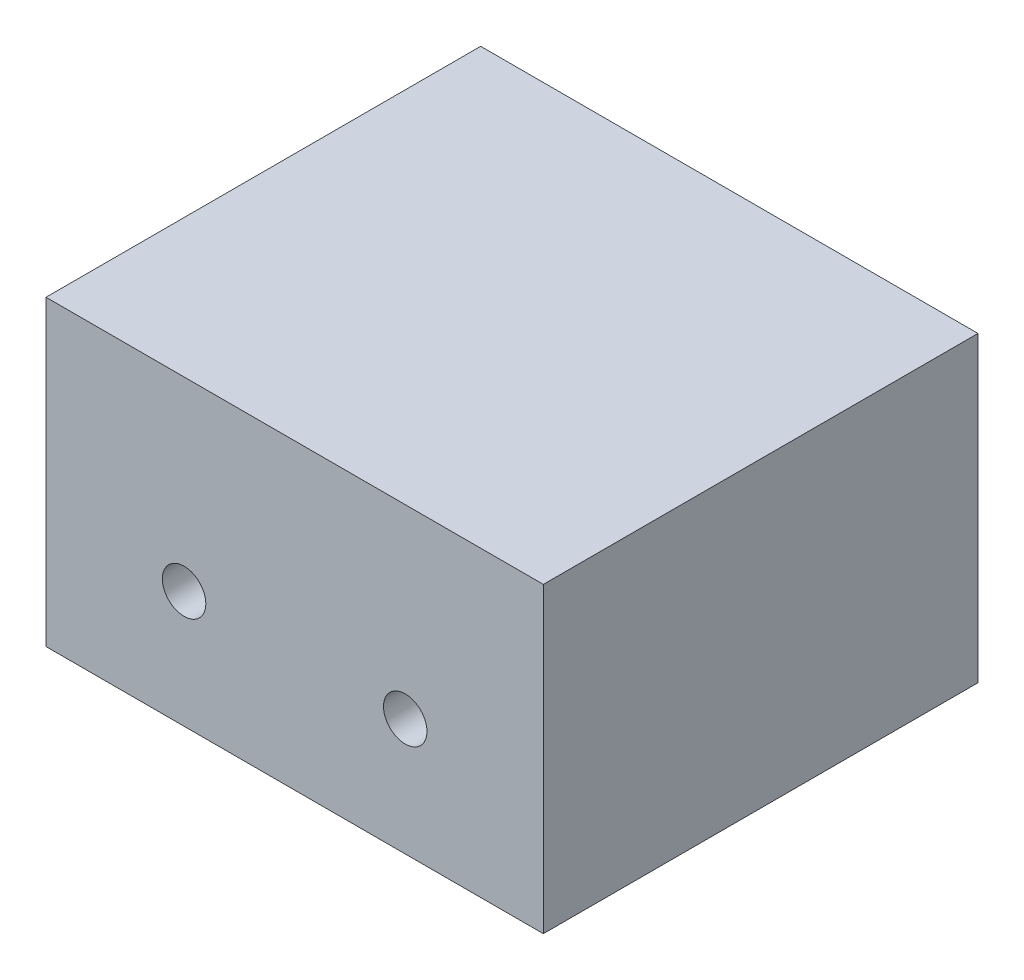
ISO-10303-21;
HEADER;
FILE_DESCRIPTION(('STEP AP214'),'2;1');
FILE_NAME('part.step','',(''),(''),'','','');
FILE_SCHEMA(('AUTOMOTIVE_DESIGN { 1 0 10303 214 1 1 1 1 }'));
ENDSEC;
DATA;
#1=APPLICATION_CONTEXT('core data for automotive mechanical design processes');
#2=APPLICATION_PROTOCOL_DEFINITION('international standard','automotive_design',2000,#1);
#3=PRODUCT_CONTEXT('',#1,'mechanical');
#4=PRODUCT('Part','Part','',(#3));
#5=PRODUCT_RELATED_PRODUCT_CATEGORY('part','',(#4));
#6=PRODUCT_DEFINITION_FORMATION('','',#4);
#7=PRODUCT_DEFINITION_CONTEXT('part definition',#1,'design');
#8=PRODUCT_DEFINITION('design','',#6,#7);
#9=PRODUCT_DEFINITION_SHAPE('','',#8);
#10=(LENGTH_UNIT() NAMED_UNIT(*) SI_UNIT(.MILLI.,.METRE.));
#11=(NAMED_UNIT(*) PLANE_ANGLE_UNIT() SI_UNIT($,.RADIAN.));
#12=(NAMED_UNIT(*) SI_UNIT($,.STERADIAN.) SOLID_ANGLE_UNIT());
#13=UNCERTAINTY_MEASURE_WITH_UNIT(LENGTH_MEASURE(1.E-05),#10,'distance_accuracy_value','');
#14=(GEOMETRIC_REPRESENTATION_CONTEXT(3) GLOBAL_UNCERTAINTY_ASSIGNED_CONTEXT((#13)) GLOBAL_UNIT_ASSIGNED_CONTEXT((#10,
#11,#12)) REPRESENTATION_CONTEXT('',''));
#15=CARTESIAN_POINT('',(0.,0.,0.));
#16=DIRECTION('',(0.,0.,1.));
#17=DIRECTION('',(1.,0.,0.));
#18=AXIS2_PLACEMENT_3D('',#15,#16,#17);
#19=CARTESIAN_POINT('',(28.605,34.8,25.));
#20=DIRECTION('',(-1.,0.,0.));
#21=DIRECTION('',(0.,0.,1.));
#22=AXIS2_PLACEMENT_3D('',#19,#20,#21);
#23=PLANE('',#22);
#24=DIRECTION('',(0.,0.,-1.));
#25=VECTOR('',#24,1.);
#26=CARTESIAN_POINT('',(28.605,0.,25.));
#27=LINE('',#26,#25);
#28=CARTESIAN_POINT('',(28.605,0.,25.));
#29=VERTEX_POINT('',#28);
#30=CARTESIAN_POINT('',(28.605,0.,-25.));
#31=VERTEX_POINT('',#30);
#32=EDGE_CURVE('E97',#29,#31,#27,.T.);
#33=ORIENTED_EDGE('',*,*,#32,.T.);
#34=DIRECTION('',(0.,-1.,0.));
#35=VECTOR('',#34,1.);
#36=CARTESIAN_POINT('',(28.605,34.8,-25.));
#37=LINE('',#36,#35);
#38=CARTESIAN_POINT('',(28.605,34.8,-25.));
#39=VERTEX_POINT('',#38);
#40=EDGE_CURVE('E11',#39,#31,#37,.T.);
#41=ORIENTED_EDGE('',*,*,#40,.F.);
#42=DIRECTION('',(0.,0.,-1.));
#43=VECTOR('',#42,1.);
#44=CARTESIAN_POINT('',(28.605,34.8,25.));
#45=LINE('',#44,#43);
#46=CARTESIAN_POINT('',(28.605,34.8,25.));
#47=VERTEX_POINT('',#46);
#48=EDGE_CURVE('E85',#47,#39,#45,.T.);
#49=ORIENTED_EDGE('',*,*,#48,.F.);
#50=DIRECTION('',(0.,-1.,0.));
#51=VECTOR('',#50,1.);
#52=CARTESIAN_POINT('',(28.605,34.8,25.));
#53=LINE('',#52,#51);
#54=EDGE_CURVE('E93',#47,#29,#53,.T.);
#55=ORIENTED_EDGE('',*,*,#54,.T.);
#56=EDGE_LOOP('',(#33,#41,#49,#55));
#57=FACE_BOUND('',#56,.T.);
#58=ADVANCED_FACE('F34',(#57),#23,.F.);
#59=CARTESIAN_POINT('',(-28.605,34.8,-25.));
#60=DIRECTION('',(0.,0.,1.));
#61=DIRECTION('',(1.,0.,0.));
#62=AXIS2_PLACEMENT_3D('',#59,#60,#61);
#63=PLANE('',#62);
#64=CARTESIAN_POINT('',(12.72,13.45,-25.));
#65=DIRECTION('',(0.,0.,-1.));
#66=DIRECTION('',(-1.,0.,0.));
#67=AXIS2_PLACEMENT_3D('',#64,#65,#66);
#68=CIRCLE('',#67,2.5);
#69=CARTESIAN_POINT('',(10.22,13.45,-25.));
#70=VERTEX_POINT('',#69);
#71=EDGE_CURVE('E114',#70,#70,#68,.T.);
#72=ORIENTED_EDGE('',*,*,#71,.F.);
#73=EDGE_LOOP('',(#72));
#74=FACE_BOUND('',#73,.T.);
#75=CARTESIAN_POINT('',(-12.72,13.45,-25.));
#76=DIRECTION('',(0.,0.,1.));
#77=DIRECTION('',(1.,0.,0.));
#78=AXIS2_PLACEMENT_3D('',#75,#76,#77);
#79=CIRCLE('',#78,2.5);
#80=CARTESIAN_POINT('',(-10.22,13.45,-25.));
#81=VERTEX_POINT('',#80);
#82=EDGE_CURVE('E100',#81,#81,#79,.T.);
#83=ORIENTED_EDGE('',*,*,#82,.T.);
#84=EDGE_LOOP('',(#83));
#85=FACE_BOUND('',#84,.T.);
#86=DIRECTION('',(-1.,0.,0.));
#87=VECTOR('',#86,1.);
#88=CARTESIAN_POINT('',(-28.605,0.,-25.));
#89=LINE('',#88,#87);
#90=CARTESIAN_POINT('',(-28.605,0.,-25.));
#91=VERTEX_POINT('',#90);
#92=EDGE_CURVE('E89',#31,#91,#89,.T.);
#93=ORIENTED_EDGE('',*,*,#92,.T.);
#94=DIRECTION('',(0.,-1.,0.));
#95=VECTOR('',#94,1.);
#96=CARTESIAN_POINT('',(-28.605,34.8,-25.));
#97=LINE('',#96,#95);
#98=CARTESIAN_POINT('',(-28.605,34.8,-25.));
#99=VERTEX_POINT('',#98);
#100=EDGE_CURVE('E42',#99,#91,#97,.T.);
#101=ORIENTED_EDGE('',*,*,#100,.F.);
#102=DIRECTION('',(-1.,0.,0.));
#103=VECTOR('',#102,1.);
#104=CARTESIAN_POINT('',(-28.605,34.8,-25.));
#105=LINE('',#104,#103);
#106=EDGE_CURVE('E80',#39,#99,#105,.T.);
#107=ORIENTED_EDGE('',*,*,#106,.F.);
#108=ORIENTED_EDGE('',*,*,#40,.T.);
#109=EDGE_LOOP('',(#93,#101,#107,#108));
#110=FACE_BOUND('',#109,.T.);
#111=ADVANCED_FACE('F88',(#74,#85,#110),#63,.F.);
#112=CARTESIAN_POINT('',(-28.605,34.8,25.));
#113=DIRECTION('',(1.,0.,0.));
#114=DIRECTION('',(0.,0.,-1.));
#115=AXIS2_PLACEMENT_3D('',#112,#113,#114);
#116=PLANE('',#115);
#117=DIRECTION('',(0.,0.,1.));
#118=VECTOR('',#117,1.);
#119=CARTESIAN_POINT('',(-28.605,0.,25.));
#120=LINE('',#119,#118);
#121=CARTESIAN_POINT('',(-28.605,0.,25.));
#122=VERTEX_POINT('',#121);
#123=EDGE_CURVE('E67',#91,#122,#120,.T.);
#124=ORIENTED_EDGE('',*,*,#123,.T.);
#125=DIRECTION('',(0.,-1.,0.));
#126=VECTOR('',#125,1.);
#127=CARTESIAN_POINT('',(-28.605,34.8,25.));
#128=LINE('',#127,#126);
#129=CARTESIAN_POINT('',(-28.605,34.8,25.));
#130=VERTEX_POINT('',#129);
#131=EDGE_CURVE('E90',#130,#122,#128,.T.);
#132=ORIENTED_EDGE('',*,*,#131,.F.);
#133=DIRECTION('',(0.,0.,1.));
#134=VECTOR('',#133,1.);
#135=CARTESIAN_POINT('',(-28.605,34.8,25.));
#136=LINE('',#135,#134);
#137=EDGE_CURVE('E83',#99,#130,#136,.T.);
#138=ORIENTED_EDGE('',*,*,#137,.F.);
#139=ORIENTED_EDGE('',*,*,#100,.T.);
#140=EDGE_LOOP('',(#124,#132,#138,#139));
#141=FACE_BOUND('',#140,.T.);
#142=ADVANCED_FACE('F91',(#141),#116,.F.);
#143=CARTESIAN_POINT('',(-28.605,34.8,25.));
#144=DIRECTION('',(0.,0.,-1.));
#145=DIRECTION('',(-1.,0.,0.));
#146=AXIS2_PLACEMENT_3D('',#143,#144,#145);
#147=PLANE('',#146);
#148=CARTESIAN_POINT('',(12.72,13.45,25.));
#149=DIRECTION('',(0.,0.,-1.));
#150=DIRECTION('',(-1.,0.,0.));
#151=AXIS2_PLACEMENT_3D('',#148,#149,#150);
#152=CIRCLE('',#151,2.5);
#153=CARTESIAN_POINT('',(10.22,13.45,25.));
#154=VERTEX_POINT('',#153);
#155=EDGE_CURVE('E117',#154,#154,#152,.T.);
#156=ORIENTED_EDGE('',*,*,#155,.T.);
#157=EDGE_LOOP('',(#156));
#158=FACE_BOUND('',#157,.T.);
#159=CARTESIAN_POINT('',(-12.72,13.45,25.));
#160=DIRECTION('',(0.,0.,1.));
#161=DIRECTION('',(1.,0.,0.));
#162=AXIS2_PLACEMENT_3D('',#159,#160,#161);
#163=CIRCLE('',#162,2.5);
#164=CARTESIAN_POINT('',(-10.22,13.45,25.));
#165=VERTEX_POINT('',#164);
#166=EDGE_CURVE('E111',#165,#165,#163,.T.);
#167=ORIENTED_EDGE('',*,*,#166,.F.);
#168=EDGE_LOOP('',(#167));
#169=FACE_BOUND('',#168,.T.);
#170=DIRECTION('',(1.,0.,0.));
#171=VECTOR('',#170,1.);
#172=CARTESIAN_POINT('',(-28.605,0.,25.));
#173=LINE('',#172,#171);
#174=EDGE_CURVE('E73',#122,#29,#173,.T.);
#175=ORIENTED_EDGE('',*,*,#174,.T.);
#176=ORIENTED_EDGE('',*,*,#54,.F.);
#177=DIRECTION('',(1.,0.,0.));
#178=VECTOR('',#177,1.);
#179=CARTESIAN_POINT('',(-28.605,34.8,25.));
#180=LINE('',#179,#178);
#181=EDGE_CURVE('E50',#130,#47,#180,.T.);
#182=ORIENTED_EDGE('',*,*,#181,.F.);
#183=ORIENTED_EDGE('',*,*,#131,.T.);
#184=EDGE_LOOP('',(#175,#176,#182,#183));
#185=FACE_BOUND('',#184,.T.);
#186=ADVANCED_FACE('F105',(#158,#169,#185),#147,.F.);
#187=CARTESIAN_POINT('',(0.,34.8,0.));
#188=DIRECTION('',(0.,-1.,0.));
#189=DIRECTION('',(0.,0.,-1.));
#190=AXIS2_PLACEMENT_3D('',#187,#188,#189);
#191=PLANE('',#190);
#192=ORIENTED_EDGE('',*,*,#48,.T.);
#193=ORIENTED_EDGE('',*,*,#106,.T.);
#194=ORIENTED_EDGE('',*,*,#137,.T.);
#195=ORIENTED_EDGE('',*,*,#181,.T.);
#196=EDGE_LOOP('',(#192,#193,#194,#195));
#197=FACE_BOUND('',#196,.T.);
#198=ADVANCED_FACE('F81',(#197),#191,.F.);
#199=CARTESIAN_POINT('',(0.,0.,0.));
#200=DIRECTION('',(0.,-1.,0.));
#201=DIRECTION('',(0.,0.,-1.));
#202=AXIS2_PLACEMENT_3D('',#199,#200,#201);
#203=PLANE('',#202);
#204=ORIENTED_EDGE('',*,*,#32,.F.);
#205=ORIENTED_EDGE('',*,*,#174,.F.);
#206=ORIENTED_EDGE('',*,*,#123,.F.);
#207=ORIENTED_EDGE('',*,*,#92,.F.);
#208=EDGE_LOOP('',(#204,#205,#206,#207));
#209=FACE_BOUND('',#208,.T.);
#210=ADVANCED_FACE('F108',(#209),#203,.T.);
#211=CARTESIAN_POINT('',(-12.72,13.45,-25.));
#212=DIRECTION('',(0.,0.,1.));
#213=DIRECTION('',(1.,0.,0.));
#214=AXIS2_PLACEMENT_3D('',#211,#212,#213);
#215=CYLINDRICAL_SURFACE('',#214,2.5);
#216=ORIENTED_EDGE('',*,*,#82,.F.);
#217=EDGE_LOOP('',(#216));
#218=FACE_BOUND('',#217,.T.);
#219=ORIENTED_EDGE('',*,*,#166,.T.);
#220=EDGE_LOOP('',(#219));
#221=FACE_BOUND('',#220,.T.);
#222=ADVANCED_FACE('F130',(#218,#221),#215,.F.);
#223=CARTESIAN_POINT('',(12.72,13.45,-25.));
#224=DIRECTION('',(0.,0.,1.));
#225=DIRECTION('',(1.,0.,0.));
#226=AXIS2_PLACEMENT_3D('',#223,#224,#225);
#227=CYLINDRICAL_SURFACE('',#226,2.5);
#228=ORIENTED_EDGE('',*,*,#71,.T.);
#229=EDGE_LOOP('',(#228));
#230=FACE_BOUND('',#229,.T.);
#231=ORIENTED_EDGE('',*,*,#155,.F.);
#232=EDGE_LOOP('',(#231));
#233=FACE_BOUND('',#232,.T.);
#234=ADVANCED_FACE('F123',(#230,#233),#227,.F.);
#235=CLOSED_SHELL('',(#58,#111,#142,#186,#198,#210,#222,#234));
#236=MANIFOLD_SOLID_BREP('B2',#235);
#237=ADVANCED_BREP_SHAPE_REPRESENTATION('',(#18,#236),#14);
#238=SHAPE_DEFINITION_REPRESENTATION(#9,#237);
ENDSEC;
END-ISO-10303-21;
